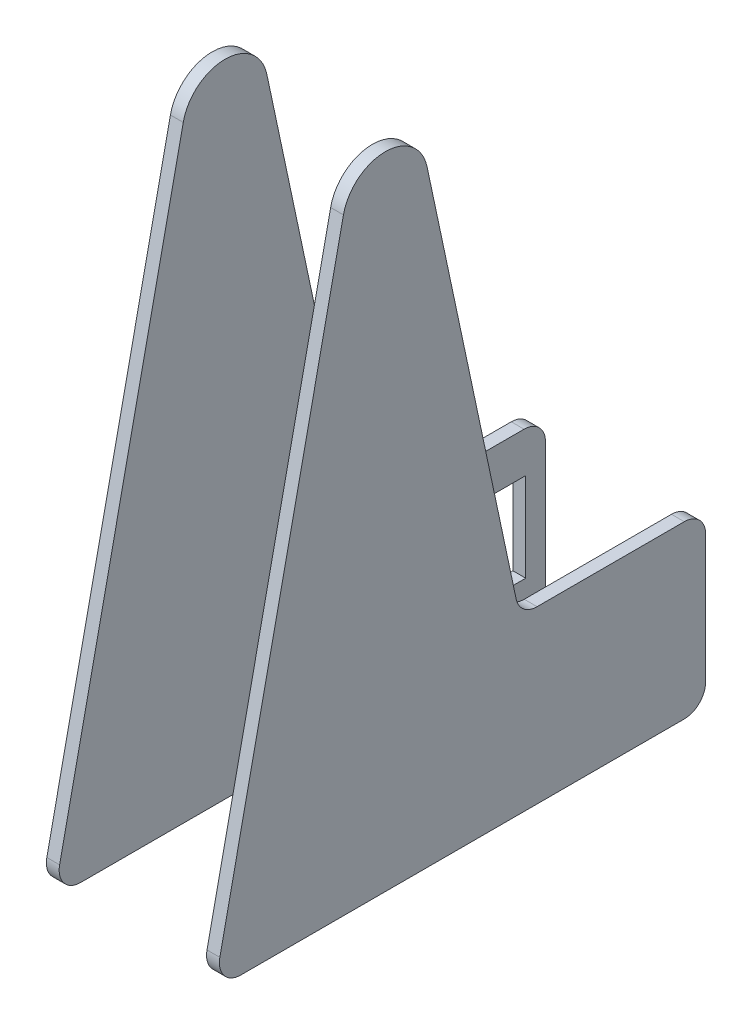
ISO-10303-21;
HEADER;
FILE_DESCRIPTION(('STEP AP214'),'2;1');
FILE_NAME('part.step','',(''),(''),'','','');
FILE_SCHEMA(('AUTOMOTIVE_DESIGN { 1 0 10303 214 1 1 1 1 }'));
ENDSEC;
DATA;
#1=APPLICATION_CONTEXT('core data for automotive mechanical design processes');
#2=APPLICATION_PROTOCOL_DEFINITION('international standard','automotive_design',2000,#1);
#3=PRODUCT_CONTEXT('',#1,'mechanical');
#4=PRODUCT('Part','Part','',(#3));
#5=PRODUCT_RELATED_PRODUCT_CATEGORY('part','',(#4));
#6=PRODUCT_DEFINITION_FORMATION('','',#4);
#7=PRODUCT_DEFINITION_CONTEXT('part definition',#1,'design');
#8=PRODUCT_DEFINITION('design','',#6,#7);
#9=PRODUCT_DEFINITION_SHAPE('','',#8);
#10=(LENGTH_UNIT() NAMED_UNIT(*) SI_UNIT(.MILLI.,.METRE.));
#11=(NAMED_UNIT(*) PLANE_ANGLE_UNIT() SI_UNIT($,.RADIAN.));
#12=(NAMED_UNIT(*) SI_UNIT($,.STERADIAN.) SOLID_ANGLE_UNIT());
#13=UNCERTAINTY_MEASURE_WITH_UNIT(LENGTH_MEASURE(1.E-05),#10,'distance_accuracy_value','');
#14=(GEOMETRIC_REPRESENTATION_CONTEXT(3) GLOBAL_UNCERTAINTY_ASSIGNED_CONTEXT((#13)) GLOBAL_UNIT_ASSIGNED_CONTEXT((#10,
#11,#12)) REPRESENTATION_CONTEXT('',''));
#15=CARTESIAN_POINT('',(0.,0.,0.));
#16=DIRECTION('',(0.,0.,1.));
#17=DIRECTION('',(1.,0.,0.));
#18=AXIS2_PLACEMENT_3D('',#15,#16,#17);
#19=CARTESIAN_POINT('',(-20.25,140.,0.));
#20=DIRECTION('',(1.,0.,0.));
#21=DIRECTION('',(0.,-1.,0.));
#22=AXIS2_PLACEMENT_3D('',#19,#20,#21);
#23=CYLINDRICAL_SURFACE('',#22,9.99999999999999);
#24=CARTESIAN_POINT('',(-17.25,140.,0.));
#25=DIRECTION('',(1.,0.,0.));
#26=DIRECTION('',(0.,0.,-1.));
#27=AXIS2_PLACEMENT_3D('',#24,#25,#26);
#28=CIRCLE('',#27,9.99999999999999);
#29=CARTESIAN_POINT('',(-17.25,142.080346989874,9.78121446456016));
#30=VERTEX_POINT('',#29);
#31=CARTESIAN_POINT('',(-17.25,142.080346989874,-9.78121446456016));
#32=VERTEX_POINT('',#31);
#33=EDGE_CURVE('E185',#30,#32,#28,.F.);
#34=ORIENTED_EDGE('',*,*,#33,.T.);
#35=DIRECTION('',(1.,0.,0.));
#36=VECTOR('',#35,1.);
#37=CARTESIAN_POINT('',(-20.25,142.080346989874,-9.78121446456016));
#38=LINE('',#37,#36);
#39=CARTESIAN_POINT('',(-20.25,142.080346989874,-9.78121446456016));
#40=VERTEX_POINT('',#39);
#41=EDGE_CURVE('E214',#40,#32,#38,.T.);
#42=ORIENTED_EDGE('',*,*,#41,.F.);
#43=CARTESIAN_POINT('',(-20.25,140.,0.));
#44=DIRECTION('',(1.,0.,0.));
#45=DIRECTION('',(0.,0.,-1.));
#46=AXIS2_PLACEMENT_3D('',#43,#44,#45);
#47=CIRCLE('',#46,9.99999999999999);
#48=CARTESIAN_POINT('',(-20.25,142.080346989874,9.78121446456016));
#49=VERTEX_POINT('',#48);
#50=EDGE_CURVE('E186',#49,#40,#47,.F.);
#51=ORIENTED_EDGE('',*,*,#50,.F.);
#52=DIRECTION('',(1.,0.,0.));
#53=VECTOR('',#52,1.);
#54=CARTESIAN_POINT('',(-20.25,142.080346989874,9.78121446456016));
#55=LINE('',#54,#53);
#56=EDGE_CURVE('E12',#49,#30,#55,.T.);
#57=ORIENTED_EDGE('',*,*,#56,.T.);
#58=EDGE_LOOP('',(#34,#42,#51,#57));
#59=FACE_BOUND('',#58,.T.);
#60=ADVANCED_FACE('F51',(#59),#23,.T.);
#61=CARTESIAN_POINT('',(-20.25,8.13932802746519,38.2688625606883));
#62=DIRECTION('',(0.,-0.208034698987433,-0.978121446456016));
#63=DIRECTION('',(0.,0.978121446456016,-0.208034698987433));
#64=AXIS2_PLACEMENT_3D('',#61,#62,#63);
#65=PLANE('',#64);
#66=DIRECTION('',(0.,-0.978121446456016,0.208034698987433));
#67=VECTOR('',#66,1.);
#68=CARTESIAN_POINT('',(-17.25,8.13932802746519,38.2688625606883));
#69=LINE('',#68,#67);
#70=CARTESIAN_POINT('',(-17.25,6.04017349493716,38.7153275501688));
#71=VERTEX_POINT('',#70);
#72=EDGE_CURVE('E217',#30,#71,#69,.T.);
#73=ORIENTED_EDGE('',*,*,#72,.F.);
#74=ORIENTED_EDGE('',*,*,#56,.F.);
#75=DIRECTION('',(0.,-0.978121446456016,0.208034698987433));
#76=VECTOR('',#75,1.);
#77=CARTESIAN_POINT('',(-20.25,8.13932802746519,38.2688625606883));
#78=LINE('',#77,#76);
#79=CARTESIAN_POINT('',(-20.25,6.04017349493716,38.7153275501688));
#80=VERTEX_POINT('',#79);
#81=EDGE_CURVE('E189',#49,#80,#78,.T.);
#82=ORIENTED_EDGE('',*,*,#81,.T.);
#83=DIRECTION('',(1.,0.,0.));
#84=VECTOR('',#83,1.);
#85=CARTESIAN_POINT('',(-20.25,6.04017349493716,38.7153275501688));
#86=LINE('',#85,#84);
#87=EDGE_CURVE('E58',#80,#71,#86,.T.);
#88=ORIENTED_EDGE('',*,*,#87,.T.);
#89=EDGE_LOOP('',(#73,#74,#82,#88));
#90=FACE_BOUND('',#89,.T.);
#91=ADVANCED_FACE('F265',(#90),#65,.F.);
#92=CARTESIAN_POINT('',(-20.25,5.,33.8247203178887));
#93=DIRECTION('',(1.,0.,0.));
#94=DIRECTION('',(0.,-1.,0.));
#95=AXIS2_PLACEMENT_3D('',#92,#93,#94);
#96=CYLINDRICAL_SURFACE('',#95,4.99999999999999);
#97=CARTESIAN_POINT('',(-17.25,5.,33.8247203178887));
#98=DIRECTION('',(1.,0.,0.));
#99=DIRECTION('',(0.,0.,-1.));
#100=AXIS2_PLACEMENT_3D('',#97,#98,#99);
#101=CIRCLE('',#100,4.99999999999999);
#102=CARTESIAN_POINT('',(-17.25,0.,33.8247203178887));
#103=VERTEX_POINT('',#102);
#104=EDGE_CURVE('E220',#71,#103,#101,.T.);
#105=ORIENTED_EDGE('',*,*,#104,.F.);
#106=ORIENTED_EDGE('',*,*,#87,.F.);
#107=CARTESIAN_POINT('',(-20.25,5.,33.8247203178887));
#108=DIRECTION('',(1.,0.,0.));
#109=DIRECTION('',(0.,0.,-1.));
#110=AXIS2_PLACEMENT_3D('',#107,#108,#109);
#111=CIRCLE('',#110,4.99999999999999);
#112=CARTESIAN_POINT('',(-20.25,0.,33.8247203178887));
#113=VERTEX_POINT('',#112);
#114=EDGE_CURVE('E193',#80,#113,#111,.T.);
#115=ORIENTED_EDGE('',*,*,#114,.T.);
#116=DIRECTION('',(1.,0.,0.));
#117=VECTOR('',#116,1.);
#118=CARTESIAN_POINT('',(-20.25,0.,33.8247203178887));
#119=LINE('',#118,#117);
#120=EDGE_CURVE('E260',#113,#103,#119,.T.);
#121=ORIENTED_EDGE('',*,*,#120,.T.);
#122=EDGE_LOOP('',(#105,#106,#115,#121));
#123=FACE_BOUND('',#122,.T.);
#124=ADVANCED_FACE('F276',(#123),#96,.T.);
#125=CARTESIAN_POINT('',(-20.25,0.,0.));
#126=DIRECTION('',(0.,1.,0.));
#127=DIRECTION('',(1.,0.,0.));
#128=AXIS2_PLACEMENT_3D('',#125,#126,#127);
#129=PLANE('',#128);
#130=DIRECTION('',(0.,0.,-1.));
#131=VECTOR('',#130,1.);
#132=CARTESIAN_POINT('',(-17.25,0.,0.));
#133=LINE('',#132,#131);
#134=CARTESIAN_POINT('',(-17.25,0.,-70.));
#135=VERTEX_POINT('',#134);
#136=EDGE_CURVE('E223',#103,#135,#133,.T.);
#137=ORIENTED_EDGE('',*,*,#136,.F.);
#138=ORIENTED_EDGE('',*,*,#120,.F.);
#139=DIRECTION('',(0.,0.,-1.));
#140=VECTOR('',#139,1.);
#141=CARTESIAN_POINT('',(-20.25,0.,0.));
#142=LINE('',#141,#140);
#143=CARTESIAN_POINT('',(-20.25,0.,-70.));
#144=VERTEX_POINT('',#143);
#145=EDGE_CURVE('E196',#113,#144,#142,.T.);
#146=ORIENTED_EDGE('',*,*,#145,.T.);
#147=DIRECTION('',(1.,0.,0.));
#148=VECTOR('',#147,1.);
#149=CARTESIAN_POINT('',(-20.25,0.,-70.));
#150=LINE('',#149,#148);
#151=EDGE_CURVE('E257',#144,#135,#150,.T.);
#152=ORIENTED_EDGE('',*,*,#151,.T.);
#153=EDGE_LOOP('',(#137,#138,#146,#152));
#154=FACE_BOUND('',#153,.T.);
#155=ADVANCED_FACE('F278',(#154),#129,.F.);
#156=CARTESIAN_POINT('',(-20.25,5.,-70.));
#157=DIRECTION('',(1.,0.,0.));
#158=DIRECTION('',(0.,-1.,0.));
#159=AXIS2_PLACEMENT_3D('',#156,#157,#158);
#160=CYLINDRICAL_SURFACE('',#159,5.);
#161=CARTESIAN_POINT('',(-17.25,5.,-70.));
#162=DIRECTION('',(1.,0.,0.));
#163=DIRECTION('',(0.,0.,-1.));
#164=AXIS2_PLACEMENT_3D('',#161,#162,#163);
#165=CIRCLE('',#164,5.);
#166=CARTESIAN_POINT('',(-17.25,5.,-75.));
#167=VERTEX_POINT('',#166);
#168=EDGE_CURVE('E226',#135,#167,#165,.T.);
#169=ORIENTED_EDGE('',*,*,#168,.F.);
#170=ORIENTED_EDGE('',*,*,#151,.F.);
#171=CARTESIAN_POINT('',(-20.25,5.,-70.));
#172=DIRECTION('',(1.,0.,0.));
#173=DIRECTION('',(0.,0.,-1.));
#174=AXIS2_PLACEMENT_3D('',#171,#172,#173);
#175=CIRCLE('',#174,5.);
#176=CARTESIAN_POINT('',(-20.25,5.,-75.));
#177=VERTEX_POINT('',#176);
#178=EDGE_CURVE('E199',#144,#177,#175,.T.);
#179=ORIENTED_EDGE('',*,*,#178,.T.);
#180=DIRECTION('',(1.,0.,0.));
#181=VECTOR('',#180,1.);
#182=CARTESIAN_POINT('',(-20.25,5.,-75.));
#183=LINE('',#182,#181);
#184=EDGE_CURVE('E254',#177,#167,#183,.T.);
#185=ORIENTED_EDGE('',*,*,#184,.T.);
#186=EDGE_LOOP('',(#169,#170,#179,#185));
#187=FACE_BOUND('',#186,.T.);
#188=ADVANCED_FACE('F282',(#187),#160,.T.);
#189=CARTESIAN_POINT('',(-20.25,0.,-75.));
#190=DIRECTION('',(0.,0.,-1.));
#191=DIRECTION('',(1.,0.,0.));
#192=AXIS2_PLACEMENT_3D('',#189,#190,#191);
#193=PLANE('',#192);
#194=DIRECTION('',(0.,-1.,0.));
#195=VECTOR('',#194,1.);
#196=CARTESIAN_POINT('',(-17.25,0.,-75.));
#197=LINE('',#196,#195);
#198=CARTESIAN_POINT('',(-17.25,35.,-75.));
#199=VERTEX_POINT('',#198);
#200=EDGE_CURVE('E229',#199,#167,#197,.T.);
#201=ORIENTED_EDGE('',*,*,#200,.T.);
#202=ORIENTED_EDGE('',*,*,#184,.F.);
#203=DIRECTION('',(0.,-1.,0.));
#204=VECTOR('',#203,1.);
#205=CARTESIAN_POINT('',(-20.25,0.,-75.));
#206=LINE('',#205,#204);
#207=CARTESIAN_POINT('',(-20.25,35.,-75.));
#208=VERTEX_POINT('',#207);
#209=EDGE_CURVE('E202',#208,#177,#206,.T.);
#210=ORIENTED_EDGE('',*,*,#209,.F.);
#211=DIRECTION('',(1.,0.,0.));
#212=VECTOR('',#211,1.);
#213=CARTESIAN_POINT('',(-20.25,35.,-75.));
#214=LINE('',#213,#212);
#215=EDGE_CURVE('E251',#208,#199,#214,.T.);
#216=ORIENTED_EDGE('',*,*,#215,.T.);
#217=EDGE_LOOP('',(#201,#202,#210,#216));
#218=FACE_BOUND('',#217,.T.);
#219=ADVANCED_FACE('F286',(#218),#193,.T.);
#220=CARTESIAN_POINT('',(-20.25,35.,-70.));
#221=DIRECTION('',(1.,0.,0.));
#222=DIRECTION('',(0.,-1.,0.));
#223=AXIS2_PLACEMENT_3D('',#220,#221,#222);
#224=CYLINDRICAL_SURFACE('',#223,5.);
#225=CARTESIAN_POINT('',(-17.25,35.,-70.));
#226=DIRECTION('',(1.,0.,0.));
#227=DIRECTION('',(0.,0.,-1.));
#228=AXIS2_PLACEMENT_3D('',#225,#226,#227);
#229=CIRCLE('',#228,5.);
#230=CARTESIAN_POINT('',(-17.25,40.,-70.));
#231=VERTEX_POINT('',#230);
#232=EDGE_CURVE('E231',#199,#231,#229,.T.);
#233=ORIENTED_EDGE('',*,*,#232,.F.);
#234=ORIENTED_EDGE('',*,*,#215,.F.);
#235=CARTESIAN_POINT('',(-20.25,35.,-70.));
#236=DIRECTION('',(1.,0.,0.));
#237=DIRECTION('',(0.,0.,-1.));
#238=AXIS2_PLACEMENT_3D('',#235,#236,#237);
#239=CIRCLE('',#238,5.);
#240=CARTESIAN_POINT('',(-20.25,40.,-70.));
#241=VERTEX_POINT('',#240);
#242=EDGE_CURVE('E204',#208,#241,#239,.T.);
#243=ORIENTED_EDGE('',*,*,#242,.T.);
#244=DIRECTION('',(1.,0.,0.));
#245=VECTOR('',#244,1.);
#246=CARTESIAN_POINT('',(-20.25,40.,-70.));
#247=LINE('',#246,#245);
#248=EDGE_CURVE('E248',#241,#231,#247,.T.);
#249=ORIENTED_EDGE('',*,*,#248,.T.);
#250=EDGE_LOOP('',(#233,#234,#243,#249));
#251=FACE_BOUND('',#250,.T.);
#252=ADVANCED_FACE('F289',(#251),#224,.T.);
#253=CARTESIAN_POINT('',(-20.25,40.,0.));
#254=DIRECTION('',(0.,1.,0.));
#255=DIRECTION('',(1.,0.,0.));
#256=AXIS2_PLACEMENT_3D('',#253,#254,#255);
#257=PLANE('',#256);
#258=DIRECTION('',(0.,0.,-1.));
#259=VECTOR('',#258,1.);
#260=CARTESIAN_POINT('',(-17.25,40.,0.));
#261=LINE('',#260,#259);
#262=CARTESIAN_POINT('',(-17.25,40.,-35.5408794375816));
#263=VERTEX_POINT('',#262);
#264=EDGE_CURVE('E234',#263,#231,#261,.T.);
#265=ORIENTED_EDGE('',*,*,#264,.T.);
#266=ORIENTED_EDGE('',*,*,#248,.F.);
#267=DIRECTION('',(0.,0.,-1.));
#268=VECTOR('',#267,1.);
#269=CARTESIAN_POINT('',(-20.25,40.,0.));
#270=LINE('',#269,#268);
#271=CARTESIAN_POINT('',(-20.25,40.,-35.5408794375816));
#272=VERTEX_POINT('',#271);
#273=EDGE_CURVE('E207',#272,#241,#270,.T.);
#274=ORIENTED_EDGE('',*,*,#273,.F.);
#275=DIRECTION('',(1.,0.,0.));
#276=VECTOR('',#275,1.);
#277=CARTESIAN_POINT('',(-20.25,40.,-35.5408794375816));
#278=LINE('',#277,#276);
#279=EDGE_CURVE('E245',#272,#263,#278,.T.);
#280=ORIENTED_EDGE('',*,*,#279,.T.);
#281=EDGE_LOOP('',(#265,#266,#274,#280));
#282=FACE_BOUND('',#281,.T.);
#283=ADVANCED_FACE('F293',(#282),#257,.T.);
#284=CARTESIAN_POINT('',(-20.25,45.,-35.5408794375816));
#285=DIRECTION('',(1.,0.,0.));
#286=DIRECTION('',(0.,-1.,0.));
#287=AXIS2_PLACEMENT_3D('',#284,#285,#286);
#288=CYLINDRICAL_SURFACE('',#287,5.);
#289=CARTESIAN_POINT('',(-17.25,45.,-35.5408794375816));
#290=DIRECTION('',(1.,0.,0.));
#291=DIRECTION('',(0.,0.,-1.));
#292=AXIS2_PLACEMENT_3D('',#289,#290,#291);
#293=CIRCLE('',#292,5.);
#294=CARTESIAN_POINT('',(-17.25,43.9598265050628,-30.6502722053015));
#295=VERTEX_POINT('',#294);
#296=EDGE_CURVE('E236',#263,#295,#293,.F.);
#297=ORIENTED_EDGE('',*,*,#296,.F.);
#298=ORIENTED_EDGE('',*,*,#279,.F.);
#299=CARTESIAN_POINT('',(-20.25,45.,-35.5408794375816));
#300=DIRECTION('',(1.,0.,0.));
#301=DIRECTION('',(0.,0.,-1.));
#302=AXIS2_PLACEMENT_3D('',#299,#300,#301);
#303=CIRCLE('',#302,5.);
#304=CARTESIAN_POINT('',(-20.25,43.9598265050628,-30.6502722053015));
#305=VERTEX_POINT('',#304);
#306=EDGE_CURVE('E209',#272,#305,#303,.F.);
#307=ORIENTED_EDGE('',*,*,#306,.T.);
#308=DIRECTION('',(1.,0.,0.));
#309=VECTOR('',#308,1.);
#310=CARTESIAN_POINT('',(-20.25,43.9598265050628,-30.6502722053015));
#311=LINE('',#310,#309);
#312=EDGE_CURVE('E242',#305,#295,#311,.T.);
#313=ORIENTED_EDGE('',*,*,#312,.T.);
#314=EDGE_LOOP('',(#297,#298,#307,#313));
#315=FACE_BOUND('',#314,.T.);
#316=ADVANCED_FACE('F297',(#315),#288,.F.);
#317=CARTESIAN_POINT('',(-20.25,8.13932802746519,-38.2688625606883));
#318=DIRECTION('',(0.,0.208034698987433,-0.978121446456016));
#319=DIRECTION('',(0.,0.978121446456016,0.208034698987433));
#320=AXIS2_PLACEMENT_3D('',#317,#318,#319);
#321=PLANE('',#320);
#322=DIRECTION('',(0.,-0.978121446456016,-0.208034698987433));
#323=VECTOR('',#322,1.);
#324=CARTESIAN_POINT('',(-17.25,8.13932802746519,-38.2688625606883));
#325=LINE('',#324,#323);
#326=EDGE_CURVE('E190',#32,#295,#325,.T.);
#327=ORIENTED_EDGE('',*,*,#326,.T.);
#328=ORIENTED_EDGE('',*,*,#312,.F.);
#329=DIRECTION('',(0.,-0.978121446456016,-0.208034698987433));
#330=VECTOR('',#329,1.);
#331=CARTESIAN_POINT('',(-20.25,8.13932802746519,-38.2688625606883));
#332=LINE('',#331,#330);
#333=EDGE_CURVE('E212',#40,#305,#332,.T.);
#334=ORIENTED_EDGE('',*,*,#333,.F.);
#335=ORIENTED_EDGE('',*,*,#41,.T.);
#336=EDGE_LOOP('',(#327,#328,#334,#335));
#337=FACE_BOUND('',#336,.T.);
#338=ADVANCED_FACE('F299',(#337),#321,.T.);
#339=CARTESIAN_POINT('',(-20.25,0.,0.));
#340=DIRECTION('',(-1.,0.,0.));
#341=DIRECTION('',(0.,0.,-1.));
#342=AXIS2_PLACEMENT_3D('',#339,#340,#341);
#343=PLANE('',#342);
#344=DIRECTION('',(0.,1.,0.));
#345=VECTOR('',#344,1.);
#346=CARTESIAN_POINT('',(-20.25,0.,-29.2133974596216));
#347=LINE('',#346,#345);
#348=CARTESIAN_POINT('',(-20.25,9.59999999999999,-29.2133974596216));
#349=VERTEX_POINT('',#348);
#350=CARTESIAN_POINT('',(-20.25,30.4,-29.2133974596216));
#351=VERTEX_POINT('',#350);
#352=EDGE_CURVE('E161',#349,#351,#347,.T.);
#353=ORIENTED_EDGE('',*,*,#352,.F.);
#354=DIRECTION('',(0.,0.,1.));
#355=VECTOR('',#354,1.);
#356=CARTESIAN_POINT('',(-20.25,9.59999999999999,0.));
#357=LINE('',#356,#355);
#358=CARTESIAN_POINT('',(-20.25,9.59999999999999,-70.3866025403785));
#359=VERTEX_POINT('',#358);
#360=EDGE_CURVE('E182',#359,#349,#357,.T.);
#361=ORIENTED_EDGE('',*,*,#360,.F.);
#362=DIRECTION('',(0.,-1.,0.));
#363=VECTOR('',#362,1.);
#364=CARTESIAN_POINT('',(-20.25,0.,-70.3866025403785));
#365=LINE('',#364,#363);
#366=CARTESIAN_POINT('',(-20.25,30.4,-70.3866025403785));
#367=VERTEX_POINT('',#366);
#368=EDGE_CURVE('E180',#367,#359,#365,.T.);
#369=ORIENTED_EDGE('',*,*,#368,.F.);
#370=DIRECTION('',(0.,0.,-1.));
#371=VECTOR('',#370,1.);
#372=CARTESIAN_POINT('',(-20.25,30.4,0.));
#373=LINE('',#372,#371);
#374=EDGE_CURVE('E153',#351,#367,#373,.T.);
#375=ORIENTED_EDGE('',*,*,#374,.F.);
#376=EDGE_LOOP('',(#353,#361,#369,#375));
#377=FACE_BOUND('',#376,.T.);
#378=ORIENTED_EDGE('',*,*,#50,.T.);
#379=ORIENTED_EDGE('',*,*,#333,.T.);
#380=ORIENTED_EDGE('',*,*,#306,.F.);
#381=ORIENTED_EDGE('',*,*,#273,.T.);
#382=ORIENTED_EDGE('',*,*,#242,.F.);
#383=ORIENTED_EDGE('',*,*,#209,.T.);
#384=ORIENTED_EDGE('',*,*,#178,.F.);
#385=ORIENTED_EDGE('',*,*,#145,.F.);
#386=ORIENTED_EDGE('',*,*,#114,.F.);
#387=ORIENTED_EDGE('',*,*,#81,.F.);
#388=EDGE_LOOP('',(#378,#379,#380,#381,#382,#383,#384,#385,#386,#387));
#389=FACE_BOUND('',#388,.T.);
#390=ADVANCED_FACE('F273',(#377,#389),#343,.T.);
#391=CARTESIAN_POINT('',(-17.25,0.,0.));
#392=DIRECTION('',(-1.,0.,0.));
#393=DIRECTION('',(0.,0.,-1.));
#394=AXIS2_PLACEMENT_3D('',#391,#392,#393);
#395=PLANE('',#394);
#396=DIRECTION('',(0.,0.,-1.));
#397=VECTOR('',#396,1.);
#398=CARTESIAN_POINT('',(-17.25,9.59999999999999,-70.3866025403785));
#399=LINE('',#398,#397);
#400=CARTESIAN_POINT('',(-17.25,9.59999999999999,-29.2133974596216));
#401=VERTEX_POINT('',#400);
#402=CARTESIAN_POINT('',(-17.25,9.59999999999999,-70.3866025403785));
#403=VERTEX_POINT('',#402);
#404=EDGE_CURVE('E167',#401,#403,#399,.T.);
#405=ORIENTED_EDGE('',*,*,#404,.F.);
#406=DIRECTION('',(0.,-1.,0.));
#407=VECTOR('',#406,1.);
#408=CARTESIAN_POINT('',(-17.25,30.4,-29.2133974596216));
#409=LINE('',#408,#407);
#410=CARTESIAN_POINT('',(-17.25,30.4,-29.2133974596216));
#411=VERTEX_POINT('',#410);
#412=EDGE_CURVE('E154',#411,#401,#409,.T.);
#413=ORIENTED_EDGE('',*,*,#412,.F.);
#414=DIRECTION('',(0.,0.,1.));
#415=VECTOR('',#414,1.);
#416=CARTESIAN_POINT('',(-17.25,30.4,-70.3866025403785));
#417=LINE('',#416,#415);
#418=CARTESIAN_POINT('',(-17.25,30.4,-70.3866025403785));
#419=VERTEX_POINT('',#418);
#420=EDGE_CURVE('E148',#419,#411,#417,.T.);
#421=ORIENTED_EDGE('',*,*,#420,.F.);
#422=DIRECTION('',(0.,1.,0.));
#423=VECTOR('',#422,1.);
#424=CARTESIAN_POINT('',(-17.25,30.4,-70.3866025403785));
#425=LINE('',#424,#423);
#426=EDGE_CURVE('E169',#403,#419,#425,.T.);
#427=ORIENTED_EDGE('',*,*,#426,.F.);
#428=EDGE_LOOP('',(#405,#413,#421,#427));
#429=FACE_BOUND('',#428,.T.);
#430=ORIENTED_EDGE('',*,*,#33,.F.);
#431=ORIENTED_EDGE('',*,*,#72,.T.);
#432=ORIENTED_EDGE('',*,*,#104,.T.);
#433=ORIENTED_EDGE('',*,*,#136,.T.);
#434=ORIENTED_EDGE('',*,*,#168,.T.);
#435=ORIENTED_EDGE('',*,*,#200,.F.);
#436=ORIENTED_EDGE('',*,*,#232,.T.);
#437=ORIENTED_EDGE('',*,*,#264,.F.);
#438=ORIENTED_EDGE('',*,*,#296,.T.);
#439=ORIENTED_EDGE('',*,*,#326,.F.);
#440=EDGE_LOOP('',(#430,#431,#432,#433,#434,#435,#436,#437,#438,#439));
#441=FACE_BOUND('',#440,.T.);
#442=ADVANCED_FACE('F165',(#429,#441),#395,.F.);
#443=CARTESIAN_POINT('',(28.8788718333981,30.4,-29.2133974596216));
#444=DIRECTION('',(0.,0.,1.));
#445=DIRECTION('',(1.,0.,0.));
#446=AXIS2_PLACEMENT_3D('',#443,#444,#445);
#447=PLANE('',#446);
#448=ORIENTED_EDGE('',*,*,#352,.T.);
#449=DIRECTION('',(-1.,0.,0.));
#450=VECTOR('',#449,1.);
#451=CARTESIAN_POINT('',(28.8788718333981,30.4,-29.2133974596216));
#452=LINE('',#451,#450);
#453=EDGE_CURVE('E65',#411,#351,#452,.T.);
#454=ORIENTED_EDGE('',*,*,#453,.F.);
#455=ORIENTED_EDGE('',*,*,#412,.T.);
#456=DIRECTION('',(-1.,0.,0.));
#457=VECTOR('',#456,1.);
#458=CARTESIAN_POINT('',(28.8788718333981,9.59999999999999,-29.2133974596216));
#459=LINE('',#458,#457);
#460=EDGE_CURVE('E173',#401,#349,#459,.T.);
#461=ORIENTED_EDGE('',*,*,#460,.T.);
#462=EDGE_LOOP('',(#448,#454,#455,#461));
#463=FACE_BOUND('',#462,.T.);
#464=ADVANCED_FACE('F157',(#463),#447,.F.);
#465=CARTESIAN_POINT('',(28.8788718333981,9.59999999999999,-70.3866025403785));
#466=DIRECTION('',(0.,-1.,0.));
#467=DIRECTION('',(0.,0.,-1.));
#468=AXIS2_PLACEMENT_3D('',#465,#466,#467);
#469=PLANE('',#468);
#470=ORIENTED_EDGE('',*,*,#360,.T.);
#471=ORIENTED_EDGE('',*,*,#460,.F.);
#472=ORIENTED_EDGE('',*,*,#404,.T.);
#473=DIRECTION('',(-1.,0.,0.));
#474=VECTOR('',#473,1.);
#475=CARTESIAN_POINT('',(28.8788718333981,9.59999999999999,-70.3866025403785));
#476=LINE('',#475,#474);
#477=EDGE_CURVE('E175',#403,#359,#476,.T.);
#478=ORIENTED_EDGE('',*,*,#477,.T.);
#479=EDGE_LOOP('',(#470,#471,#472,#478));
#480=FACE_BOUND('',#479,.T.);
#481=ADVANCED_FACE('F365',(#480),#469,.F.);
#482=CARTESIAN_POINT('',(28.8788718333981,30.4,-70.3866025403785));
#483=DIRECTION('',(0.,0.,-1.));
#484=DIRECTION('',(-1.,0.,0.));
#485=AXIS2_PLACEMENT_3D('',#482,#483,#484);
#486=PLANE('',#485);
#487=ORIENTED_EDGE('',*,*,#368,.T.);
#488=ORIENTED_EDGE('',*,*,#477,.F.);
#489=ORIENTED_EDGE('',*,*,#426,.T.);
#490=DIRECTION('',(-1.,0.,0.));
#491=VECTOR('',#490,1.);
#492=CARTESIAN_POINT('',(28.8788718333981,30.4,-70.3866025403785));
#493=LINE('',#492,#491);
#494=EDGE_CURVE('E70',#419,#367,#493,.T.);
#495=ORIENTED_EDGE('',*,*,#494,.T.);
#496=EDGE_LOOP('',(#487,#488,#489,#495));
#497=FACE_BOUND('',#496,.T.);
#498=ADVANCED_FACE('F374',(#497),#486,.F.);
#499=CARTESIAN_POINT('',(28.8788718333981,30.4,-70.3866025403785));
#500=DIRECTION('',(0.,1.,0.));
#501=DIRECTION('',(0.,0.,1.));
#502=AXIS2_PLACEMENT_3D('',#499,#500,#501);
#503=PLANE('',#502);
#504=ORIENTED_EDGE('',*,*,#374,.T.);
#505=ORIENTED_EDGE('',*,*,#494,.F.);
#506=ORIENTED_EDGE('',*,*,#420,.T.);
#507=ORIENTED_EDGE('',*,*,#453,.T.);
#508=EDGE_LOOP('',(#504,#505,#506,#507));
#509=FACE_BOUND('',#508,.T.);
#510=ADVANCED_FACE('F149',(#509),#503,.F.);
#511=CLOSED_SHELL('',(#60,#91,#124,#155,#188,#219,#252,#283,#316,#338,#390,#442,#464,#481,#498,#510));
#512=MANIFOLD_SOLID_BREP('B2',#511);
#513=CARTESIAN_POINT('',(20.25,140.,0.));
#514=DIRECTION('',(-1.,0.,0.));
#515=DIRECTION('',(0.,-1.,0.));
#516=AXIS2_PLACEMENT_3D('',#513,#514,#515);
#517=CYLINDRICAL_SURFACE('',#516,9.99999999999999);
#518=CARTESIAN_POINT('',(17.25,140.,0.));
#519=DIRECTION('',(1.,0.,0.));
#520=DIRECTION('',(0.,0.,-1.));
#521=AXIS2_PLACEMENT_3D('',#518,#519,#520);
#522=CIRCLE('',#521,9.99999999999999);
#523=CARTESIAN_POINT('',(17.25,142.080346989874,9.78121446456016));
#524=VERTEX_POINT('',#523);
#525=CARTESIAN_POINT('',(17.25,142.080346989874,-9.78121446456016));
#526=VERTEX_POINT('',#525);
#527=EDGE_CURVE('E548',#524,#526,#522,.F.);
#528=ORIENTED_EDGE('',*,*,#527,.F.);
#529=DIRECTION('',(-1.,0.,0.));
#530=VECTOR('',#529,1.);
#531=CARTESIAN_POINT('',(20.25,142.080346989874,9.78121446456016));
#532=LINE('',#531,#530);
#533=CARTESIAN_POINT('',(20.25,142.080346989874,9.78121446456016));
#534=VERTEX_POINT('',#533);
#535=EDGE_CURVE('E49',#534,#524,#532,.T.);
#536=ORIENTED_EDGE('',*,*,#535,.F.);
#537=CARTESIAN_POINT('',(20.25,140.,0.));
#538=DIRECTION('',(1.,0.,0.));
#539=DIRECTION('',(0.,0.,-1.));
#540=AXIS2_PLACEMENT_3D('',#537,#538,#539);
#541=CIRCLE('',#540,9.99999999999999);
#542=CARTESIAN_POINT('',(20.25,142.080346989874,-9.78121446456016));
#543=VERTEX_POINT('',#542);
#544=EDGE_CURVE('E571',#534,#543,#541,.F.);
#545=ORIENTED_EDGE('',*,*,#544,.T.);
#546=DIRECTION('',(-1.,0.,0.));
#547=VECTOR('',#546,1.);
#548=CARTESIAN_POINT('',(20.25,142.080346989874,-9.78121446456016));
#549=LINE('',#548,#547);
#550=EDGE_CURVE('E456',#543,#526,#549,.T.);
#551=ORIENTED_EDGE('',*,*,#550,.T.);
#552=EDGE_LOOP('',(#528,#536,#545,#551));
#553=FACE_BOUND('',#552,.T.);
#554=ADVANCED_FACE('F440',(#553),#517,.T.);
#555=CARTESIAN_POINT('',(20.25,8.13932802746519,38.2688625606883));
#556=DIRECTION('',(0.,-0.208034698987433,-0.978121446456016));
#557=DIRECTION('',(0.,0.978121446456016,-0.208034698987433));
#558=AXIS2_PLACEMENT_3D('',#555,#556,#557);
#559=PLANE('',#558);
#560=DIRECTION('',(0.,-0.978121446456016,0.208034698987433));
#561=VECTOR('',#560,1.);
#562=CARTESIAN_POINT('',(17.25,8.13932802746519,38.2688625606883));
#563=LINE('',#562,#561);
#564=CARTESIAN_POINT('',(17.25,6.04017349493716,38.7153275501688));
#565=VERTEX_POINT('',#564);
#566=EDGE_CURVE('E550',#524,#565,#563,.T.);
#567=ORIENTED_EDGE('',*,*,#566,.T.);
#568=DIRECTION('',(-1.,0.,0.));
#569=VECTOR('',#568,1.);
#570=CARTESIAN_POINT('',(20.25,6.04017349493716,38.7153275501688));
#571=LINE('',#570,#569);
#572=CARTESIAN_POINT('',(20.25,6.04017349493716,38.7153275501688));
#573=VERTEX_POINT('',#572);
#574=EDGE_CURVE('E448',#573,#565,#571,.T.);
#575=ORIENTED_EDGE('',*,*,#574,.F.);
#576=DIRECTION('',(0.,-0.978121446456016,0.208034698987433));
#577=VECTOR('',#576,1.);
#578=CARTESIAN_POINT('',(20.25,8.13932802746519,38.2688625606883));
#579=LINE('',#578,#577);
#580=EDGE_CURVE('E613',#534,#573,#579,.T.);
#581=ORIENTED_EDGE('',*,*,#580,.F.);
#582=ORIENTED_EDGE('',*,*,#535,.T.);
#583=EDGE_LOOP('',(#567,#575,#581,#582));
#584=FACE_BOUND('',#583,.T.);
#585=ADVANCED_FACE('F626',(#584),#559,.F.);
#586=CARTESIAN_POINT('',(20.25,5.,33.8247203178887));
#587=DIRECTION('',(-1.,0.,0.));
#588=DIRECTION('',(0.,-1.,0.));
#589=AXIS2_PLACEMENT_3D('',#586,#587,#588);
#590=CYLINDRICAL_SURFACE('',#589,4.99999999999999);
#591=CARTESIAN_POINT('',(17.25,5.,33.8247203178887));
#592=DIRECTION('',(1.,0.,0.));
#593=DIRECTION('',(0.,0.,-1.));
#594=AXIS2_PLACEMENT_3D('',#591,#592,#593);
#595=CIRCLE('',#594,4.99999999999999);
#596=CARTESIAN_POINT('',(17.25,0.,33.8247203178887));
#597=VERTEX_POINT('',#596);
#598=EDGE_CURVE('E552',#565,#597,#595,.T.);
#599=ORIENTED_EDGE('',*,*,#598,.T.);
#600=DIRECTION('',(-1.,0.,0.));
#601=VECTOR('',#600,1.);
#602=CARTESIAN_POINT('',(20.25,0.,33.8247203178887));
#603=LINE('',#602,#601);
#604=CARTESIAN_POINT('',(20.25,0.,33.8247203178887));
#605=VERTEX_POINT('',#604);
#606=EDGE_CURVE('E582',#605,#597,#603,.T.);
#607=ORIENTED_EDGE('',*,*,#606,.F.);
#608=CARTESIAN_POINT('',(20.25,5.,33.8247203178887));
#609=DIRECTION('',(1.,0.,0.));
#610=DIRECTION('',(0.,0.,-1.));
#611=AXIS2_PLACEMENT_3D('',#608,#609,#610);
#612=CIRCLE('',#611,4.99999999999999);
#613=EDGE_CURVE('E591',#573,#605,#612,.T.);
#614=ORIENTED_EDGE('',*,*,#613,.F.);
#615=ORIENTED_EDGE('',*,*,#574,.T.);
#616=EDGE_LOOP('',(#599,#607,#614,#615));
#617=FACE_BOUND('',#616,.T.);
#618=ADVANCED_FACE('F589',(#617),#590,.T.);
#619=CARTESIAN_POINT('',(20.25,0.,0.));
#620=DIRECTION('',(0.,1.,0.));
#621=DIRECTION('',(-1.,0.,0.));
#622=AXIS2_PLACEMENT_3D('',#619,#620,#621);
#623=PLANE('',#622);
#624=DIRECTION('',(0.,0.,-1.));
#625=VECTOR('',#624,1.);
#626=CARTESIAN_POINT('',(17.25,0.,0.));
#627=LINE('',#626,#625);
#628=CARTESIAN_POINT('',(17.25,0.,-70.));
#629=VERTEX_POINT('',#628);
#630=EDGE_CURVE('E554',#597,#629,#627,.T.);
#631=ORIENTED_EDGE('',*,*,#630,.T.);
#632=DIRECTION('',(-1.,0.,0.));
#633=VECTOR('',#632,1.);
#634=CARTESIAN_POINT('',(20.25,0.,-70.));
#635=LINE('',#634,#633);
#636=CARTESIAN_POINT('',(20.25,0.,-70.));
#637=VERTEX_POINT('',#636);
#638=EDGE_CURVE('E579',#637,#629,#635,.T.);
#639=ORIENTED_EDGE('',*,*,#638,.F.);
#640=DIRECTION('',(0.,0.,-1.));
#641=VECTOR('',#640,1.);
#642=CARTESIAN_POINT('',(20.25,0.,0.));
#643=LINE('',#642,#641);
#644=EDGE_CURVE('E608',#605,#637,#643,.T.);
#645=ORIENTED_EDGE('',*,*,#644,.F.);
#646=ORIENTED_EDGE('',*,*,#606,.T.);
#647=EDGE_LOOP('',(#631,#639,#645,#646));
#648=FACE_BOUND('',#647,.T.);
#649=ADVANCED_FACE('F600',(#648),#623,.F.);
#650=CARTESIAN_POINT('',(20.25,5.,-70.));
#651=DIRECTION('',(-1.,0.,0.));
#652=DIRECTION('',(0.,-1.,0.));
#653=AXIS2_PLACEMENT_3D('',#650,#651,#652);
#654=CYLINDRICAL_SURFACE('',#653,5.);
#655=CARTESIAN_POINT('',(17.25,5.,-70.));
#656=DIRECTION('',(1.,0.,0.));
#657=DIRECTION('',(0.,0.,-1.));
#658=AXIS2_PLACEMENT_3D('',#655,#656,#657);
#659=CIRCLE('',#658,5.);
#660=CARTESIAN_POINT('',(17.25,5.,-75.));
#661=VERTEX_POINT('',#660);
#662=EDGE_CURVE('E556',#629,#661,#659,.T.);
#663=ORIENTED_EDGE('',*,*,#662,.T.);
#664=DIRECTION('',(-1.,0.,0.));
#665=VECTOR('',#664,1.);
#666=CARTESIAN_POINT('',(20.25,5.,-75.));
#667=LINE('',#666,#665);
#668=CARTESIAN_POINT('',(20.25,5.,-75.));
#669=VERTEX_POINT('',#668);
#670=EDGE_CURVE('E577',#669,#661,#667,.T.);
#671=ORIENTED_EDGE('',*,*,#670,.F.);
#672=CARTESIAN_POINT('',(20.25,5.,-70.));
#673=DIRECTION('',(1.,0.,0.));
#674=DIRECTION('',(0.,0.,-1.));
#675=AXIS2_PLACEMENT_3D('',#672,#673,#674);
#676=CIRCLE('',#675,5.);
#677=EDGE_CURVE('E606',#637,#669,#676,.T.);
#678=ORIENTED_EDGE('',*,*,#677,.F.);
#679=ORIENTED_EDGE('',*,*,#638,.T.);
#680=EDGE_LOOP('',(#663,#671,#678,#679));
#681=FACE_BOUND('',#680,.T.);
#682=ADVANCED_FACE('F604',(#681),#654,.T.);
#683=CARTESIAN_POINT('',(20.25,0.,-75.));
#684=DIRECTION('',(0.,0.,-1.));
#685=DIRECTION('',(-1.,0.,0.));
#686=AXIS2_PLACEMENT_3D('',#683,#684,#685);
#687=PLANE('',#686);
#688=DIRECTION('',(0.,-1.,0.));
#689=VECTOR('',#688,1.);
#690=CARTESIAN_POINT('',(17.25,0.,-75.));
#691=LINE('',#690,#689);
#692=CARTESIAN_POINT('',(17.25,35.,-75.));
#693=VERTEX_POINT('',#692);
#694=EDGE_CURVE('E559',#693,#661,#691,.T.);
#695=ORIENTED_EDGE('',*,*,#694,.F.);
#696=DIRECTION('',(-1.,0.,0.));
#697=VECTOR('',#696,1.);
#698=CARTESIAN_POINT('',(20.25,35.,-75.));
#699=LINE('',#698,#697);
#700=CARTESIAN_POINT('',(20.25,35.,-75.));
#701=VERTEX_POINT('',#700);
#702=EDGE_CURVE('E575',#701,#693,#699,.T.);
#703=ORIENTED_EDGE('',*,*,#702,.F.);
#704=DIRECTION('',(0.,-1.,0.));
#705=VECTOR('',#704,1.);
#706=CARTESIAN_POINT('',(20.25,0.,-75.));
#707=LINE('',#706,#705);
#708=EDGE_CURVE('E543',#701,#669,#707,.T.);
#709=ORIENTED_EDGE('',*,*,#708,.T.);
#710=ORIENTED_EDGE('',*,*,#670,.T.);
#711=EDGE_LOOP('',(#695,#703,#709,#710));
#712=FACE_BOUND('',#711,.T.);
#713=ADVANCED_FACE('F639',(#712),#687,.T.);
#714=CARTESIAN_POINT('',(20.25,35.,-70.));
#715=DIRECTION('',(-1.,0.,0.));
#716=DIRECTION('',(0.,-1.,0.));
#717=AXIS2_PLACEMENT_3D('',#714,#715,#716);
#718=CYLINDRICAL_SURFACE('',#717,5.);
#719=CARTESIAN_POINT('',(17.25,35.,-70.));
#720=DIRECTION('',(1.,0.,0.));
#721=DIRECTION('',(0.,0.,-1.));
#722=AXIS2_PLACEMENT_3D('',#719,#720,#721);
#723=CIRCLE('',#722,5.);
#724=CARTESIAN_POINT('',(17.25,40.,-70.));
#725=VERTEX_POINT('',#724);
#726=EDGE_CURVE('E562',#693,#725,#723,.T.);
#727=ORIENTED_EDGE('',*,*,#726,.T.);
#728=DIRECTION('',(-1.,0.,0.));
#729=VECTOR('',#728,1.);
#730=CARTESIAN_POINT('',(20.25,40.,-70.));
#731=LINE('',#730,#729);
#732=CARTESIAN_POINT('',(20.25,40.,-70.));
#733=VERTEX_POINT('',#732);
#734=EDGE_CURVE('E528',#733,#725,#731,.T.);
#735=ORIENTED_EDGE('',*,*,#734,.F.);
#736=CARTESIAN_POINT('',(20.25,35.,-70.));
#737=DIRECTION('',(1.,0.,0.));
#738=DIRECTION('',(0.,0.,-1.));
#739=AXIS2_PLACEMENT_3D('',#736,#737,#738);
#740=CIRCLE('',#739,5.);
#741=EDGE_CURVE('E540',#701,#733,#740,.T.);
#742=ORIENTED_EDGE('',*,*,#741,.F.);
#743=ORIENTED_EDGE('',*,*,#702,.T.);
#744=EDGE_LOOP('',(#727,#735,#742,#743));
#745=FACE_BOUND('',#744,.T.);
#746=ADVANCED_FACE('F642',(#745),#718,.T.);
#747=CARTESIAN_POINT('',(20.25,40.,0.));
#748=DIRECTION('',(0.,1.,0.));
#749=DIRECTION('',(-1.,0.,0.));
#750=AXIS2_PLACEMENT_3D('',#747,#748,#749);
#751=PLANE('',#750);
#752=DIRECTION('',(0.,0.,-1.));
#753=VECTOR('',#752,1.);
#754=CARTESIAN_POINT('',(17.25,40.,0.));
#755=LINE('',#754,#753);
#756=CARTESIAN_POINT('',(17.25,40.,-35.5408794375816));
#757=VERTEX_POINT('',#756);
#758=EDGE_CURVE('E525',#757,#725,#755,.T.);
#759=ORIENTED_EDGE('',*,*,#758,.F.);
#760=DIRECTION('',(-1.,0.,0.));
#761=VECTOR('',#760,1.);
#762=CARTESIAN_POINT('',(20.25,40.,-35.5408794375816));
#763=LINE('',#762,#761);
#764=CARTESIAN_POINT('',(20.25,40.,-35.5408794375816));
#765=VERTEX_POINT('',#764);
#766=EDGE_CURVE('E519',#765,#757,#763,.T.);
#767=ORIENTED_EDGE('',*,*,#766,.F.);
#768=DIRECTION('',(0.,0.,-1.));
#769=VECTOR('',#768,1.);
#770=CARTESIAN_POINT('',(20.25,40.,0.));
#771=LINE('',#770,#769);
#772=EDGE_CURVE('E523',#765,#733,#771,.T.);
#773=ORIENTED_EDGE('',*,*,#772,.T.);
#774=ORIENTED_EDGE('',*,*,#734,.T.);
#775=EDGE_LOOP('',(#759,#767,#773,#774));
#776=FACE_BOUND('',#775,.T.);
#777=ADVANCED_FACE('F521',(#776),#751,.T.);
#778=CARTESIAN_POINT('',(20.25,45.,-35.5408794375816));
#779=DIRECTION('',(-1.,0.,0.));
#780=DIRECTION('',(0.,-1.,0.));
#781=AXIS2_PLACEMENT_3D('',#778,#779,#780);
#782=CYLINDRICAL_SURFACE('',#781,5.);
#783=CARTESIAN_POINT('',(17.25,45.,-35.5408794375816));
#784=DIRECTION('',(1.,0.,0.));
#785=DIRECTION('',(0.,0.,-1.));
#786=AXIS2_PLACEMENT_3D('',#783,#784,#785);
#787=CIRCLE('',#786,5.);
#788=CARTESIAN_POINT('',(17.25,43.9598265050628,-30.6502722053015));
#789=VERTEX_POINT('',#788);
#790=EDGE_CURVE('E566',#757,#789,#787,.F.);
#791=ORIENTED_EDGE('',*,*,#790,.T.);
#792=DIRECTION('',(-1.,0.,0.));
#793=VECTOR('',#792,1.);
#794=CARTESIAN_POINT('',(20.25,43.9598265050628,-30.6502722053015));
#795=LINE('',#794,#793);
#796=CARTESIAN_POINT('',(20.25,43.9598265050628,-30.6502722053015));
#797=VERTEX_POINT('',#796);
#798=EDGE_CURVE('E488',#797,#789,#795,.T.);
#799=ORIENTED_EDGE('',*,*,#798,.F.);
#800=CARTESIAN_POINT('',(20.25,45.,-35.5408794375816));
#801=DIRECTION('',(1.,0.,0.));
#802=DIRECTION('',(0.,0.,-1.));
#803=AXIS2_PLACEMENT_3D('',#800,#801,#802);
#804=CIRCLE('',#803,5.);
#805=EDGE_CURVE('E530',#765,#797,#804,.F.);
#806=ORIENTED_EDGE('',*,*,#805,.F.);
#807=ORIENTED_EDGE('',*,*,#766,.T.);
#808=EDGE_LOOP('',(#791,#799,#806,#807));
#809=FACE_BOUND('',#808,.T.);
#810=ADVANCED_FACE('F531',(#809),#782,.F.);
#811=CARTESIAN_POINT('',(20.25,8.13932802746519,-38.2688625606883));
#812=DIRECTION('',(0.,0.208034698987433,-0.978121446456016));
#813=DIRECTION('',(0.,0.978121446456016,0.208034698987433));
#814=AXIS2_PLACEMENT_3D('',#811,#812,#813);
#815=PLANE('',#814);
#816=DIRECTION('',(0.,-0.978121446456016,-0.208034698987433));
#817=VECTOR('',#816,1.);
#818=CARTESIAN_POINT('',(17.25,8.13932802746519,-38.2688625606883));
#819=LINE('',#818,#817);
#820=EDGE_CURVE('E568',#526,#789,#819,.T.);
#821=ORIENTED_EDGE('',*,*,#820,.F.);
#822=ORIENTED_EDGE('',*,*,#550,.F.);
#823=DIRECTION('',(0.,-0.978121446456016,-0.208034698987433));
#824=VECTOR('',#823,1.);
#825=CARTESIAN_POINT('',(20.25,8.13932802746519,-38.2688625606883));
#826=LINE('',#825,#824);
#827=EDGE_CURVE('E534',#543,#797,#826,.T.);
#828=ORIENTED_EDGE('',*,*,#827,.T.);
#829=ORIENTED_EDGE('',*,*,#798,.T.);
#830=EDGE_LOOP('',(#821,#822,#828,#829));
#831=FACE_BOUND('',#830,.T.);
#832=ADVANCED_FACE('F615',(#831),#815,.T.);
#833=CARTESIAN_POINT('',(20.25,0.,0.));
#834=DIRECTION('',(1.,0.,0.));
#835=DIRECTION('',(0.,0.,-1.));
#836=AXIS2_PLACEMENT_3D('',#833,#834,#835);
#837=PLANE('',#836);
#838=ORIENTED_EDGE('',*,*,#544,.F.);
#839=ORIENTED_EDGE('',*,*,#580,.T.);
#840=ORIENTED_EDGE('',*,*,#613,.T.);
#841=ORIENTED_EDGE('',*,*,#644,.T.);
#842=ORIENTED_EDGE('',*,*,#677,.T.);
#843=ORIENTED_EDGE('',*,*,#708,.F.);
#844=ORIENTED_EDGE('',*,*,#741,.T.);
#845=ORIENTED_EDGE('',*,*,#772,.F.);
#846=ORIENTED_EDGE('',*,*,#805,.T.);
#847=ORIENTED_EDGE('',*,*,#827,.F.);
#848=EDGE_LOOP('',(#838,#839,#840,#841,#842,#843,#844,#845,#846,#847));
#849=FACE_BOUND('',#848,.T.);
#850=ADVANCED_FACE('F537',(#849),#837,.T.);
#851=CARTESIAN_POINT('',(17.25,0.,0.));
#852=DIRECTION('',(1.,0.,0.));
#853=DIRECTION('',(0.,0.,-1.));
#854=AXIS2_PLACEMENT_3D('',#851,#852,#853);
#855=PLANE('',#854);
#856=ORIENTED_EDGE('',*,*,#527,.T.);
#857=ORIENTED_EDGE('',*,*,#820,.T.);
#858=ORIENTED_EDGE('',*,*,#790,.F.);
#859=ORIENTED_EDGE('',*,*,#758,.T.);
#860=ORIENTED_EDGE('',*,*,#726,.F.);
#861=ORIENTED_EDGE('',*,*,#694,.T.);
#862=ORIENTED_EDGE('',*,*,#662,.F.);
#863=ORIENTED_EDGE('',*,*,#630,.F.);
#864=ORIENTED_EDGE('',*,*,#598,.F.);
#865=ORIENTED_EDGE('',*,*,#566,.F.);
#866=EDGE_LOOP('',(#856,#857,#858,#859,#860,#861,#862,#863,#864,#865));
#867=FACE_BOUND('',#866,.T.);
#868=ADVANCED_FACE('F596',(#867),#855,.F.);
#869=CLOSED_SHELL('',(#554,#585,#618,#649,#682,#713,#746,#777,#810,#832,#850,#868));
#870=MANIFOLD_SOLID_BREP('B6',#869);
#871=ADVANCED_BREP_SHAPE_REPRESENTATION('',(#18,#512,#870),#14);
#872=SHAPE_DEFINITION_REPRESENTATION(#9,#871);
ENDSEC;
END-ISO-10303-21;
